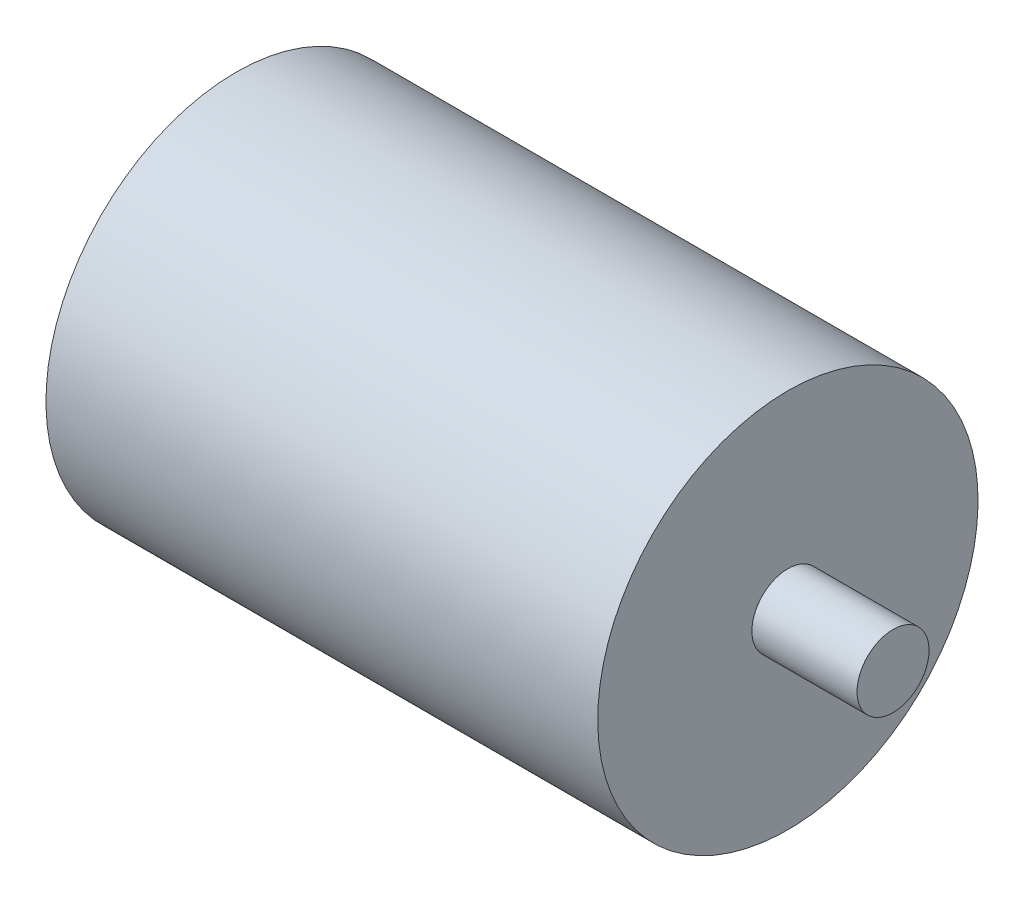
ISO-10303-21;
HEADER;
FILE_DESCRIPTION(('STEP AP214'),'2;1');
FILE_NAME('part.step','',(''),(''),'','','');
FILE_SCHEMA(('AUTOMOTIVE_DESIGN { 1 0 10303 214 1 1 1 1 }'));
ENDSEC;
DATA;
#1=APPLICATION_CONTEXT('core data for automotive mechanical design processes');
#2=APPLICATION_PROTOCOL_DEFINITION('international standard','automotive_design',2000,#1);
#3=PRODUCT_CONTEXT('',#1,'mechanical');
#4=PRODUCT('Part','Part','',(#3));
#5=PRODUCT_RELATED_PRODUCT_CATEGORY('part','',(#4));
#6=PRODUCT_DEFINITION_FORMATION('','',#4);
#7=PRODUCT_DEFINITION_CONTEXT('part definition',#1,'design');
#8=PRODUCT_DEFINITION('design','',#6,#7);
#9=PRODUCT_DEFINITION_SHAPE('','',#8);
#10=(LENGTH_UNIT() NAMED_UNIT(*) SI_UNIT(.MILLI.,.METRE.));
#11=(NAMED_UNIT(*) PLANE_ANGLE_UNIT() SI_UNIT($,.RADIAN.));
#12=(NAMED_UNIT(*) SI_UNIT($,.STERADIAN.) SOLID_ANGLE_UNIT());
#13=UNCERTAINTY_MEASURE_WITH_UNIT(LENGTH_MEASURE(1.E-05),#10,'distance_accuracy_value','');
#14=(GEOMETRIC_REPRESENTATION_CONTEXT(3) GLOBAL_UNCERTAINTY_ASSIGNED_CONTEXT((#13)) GLOBAL_UNIT_ASSIGNED_CONTEXT((#10,
#11,#12)) REPRESENTATION_CONTEXT('',''));
#15=CARTESIAN_POINT('',(0.,0.,0.));
#16=DIRECTION('',(0.,0.,1.));
#17=DIRECTION('',(1.,0.,0.));
#18=AXIS2_PLACEMENT_3D('',#15,#16,#17);
#19=CARTESIAN_POINT('',(-48.641,0.,0.));
#20=DIRECTION('',(1.,0.,0.));
#21=DIRECTION('',(0.,1.,0.));
#22=AXIS2_PLACEMENT_3D('',#19,#20,#21);
#23=PLANE('',#22);
#24=CARTESIAN_POINT('',(-48.641,0.,0.));
#25=DIRECTION('',(-1.,0.,0.));
#26=DIRECTION('',(0.,-1.,0.));
#27=AXIS2_PLACEMENT_3D('',#24,#25,#26);
#28=CIRCLE('',#27,6.35);
#29=CARTESIAN_POINT('',(-48.641,-6.35,0.));
#30=VERTEX_POINT('',#29);
#31=EDGE_CURVE('E11',#30,#30,#28,.T.);
#32=ORIENTED_EDGE('',*,*,#31,.F.);
#33=EDGE_LOOP('',(#32));
#34=FACE_BOUND('',#33,.T.);
#35=CARTESIAN_POINT('',(-48.641,0.,0.));
#36=DIRECTION('',(1.,0.,0.));
#37=DIRECTION('',(0.,1.,0.));
#38=AXIS2_PLACEMENT_3D('',#35,#36,#37);
#39=CIRCLE('',#38,33.528);
#40=CARTESIAN_POINT('',(-48.641,33.528,0.));
#41=VERTEX_POINT('',#40);
#42=EDGE_CURVE('E68',#41,#41,#39,.T.);
#43=ORIENTED_EDGE('',*,*,#42,.F.);
#44=EDGE_LOOP('',(#43));
#45=FACE_BOUND('',#44,.T.);
#46=ADVANCED_FACE('F49',(#34,#45),#23,.F.);
#47=CARTESIAN_POINT('',(48.641,0.,0.));
#48=DIRECTION('',(1.,0.,0.));
#49=DIRECTION('',(0.,1.,0.));
#50=AXIS2_PLACEMENT_3D('',#47,#48,#49);
#51=PLANE('',#50);
#52=CARTESIAN_POINT('',(48.641,0.,0.));
#53=DIRECTION('',(1.,0.,0.));
#54=DIRECTION('',(0.,1.,0.));
#55=AXIS2_PLACEMENT_3D('',#52,#53,#54);
#56=CIRCLE('',#55,6.35);
#57=CARTESIAN_POINT('',(48.641,6.35000000000002,0.));
#58=VERTEX_POINT('',#57);
#59=EDGE_CURVE('E56',#58,#58,#56,.T.);
#60=ORIENTED_EDGE('',*,*,#59,.F.);
#61=EDGE_LOOP('',(#60));
#62=FACE_BOUND('',#61,.T.);
#63=CARTESIAN_POINT('',(48.641,0.,0.));
#64=DIRECTION('',(1.,0.,0.));
#65=DIRECTION('',(0.,1.,0.));
#66=AXIS2_PLACEMENT_3D('',#63,#64,#65);
#67=CIRCLE('',#66,33.528);
#68=CARTESIAN_POINT('',(48.641,33.528,0.));
#69=VERTEX_POINT('',#68);
#70=EDGE_CURVE('E52',#69,#69,#67,.T.);
#71=ORIENTED_EDGE('',*,*,#70,.T.);
#72=EDGE_LOOP('',(#71));
#73=FACE_BOUND('',#72,.T.);
#74=ADVANCED_FACE('F75',(#62,#73),#51,.T.);
#75=CARTESIAN_POINT('',(-48.641,0.,0.));
#76=DIRECTION('',(1.,0.,0.));
#77=DIRECTION('',(0.,1.,0.));
#78=AXIS2_PLACEMENT_3D('',#75,#76,#77);
#79=CYLINDRICAL_SURFACE('',#78,33.528);
#80=ORIENTED_EDGE('',*,*,#70,.F.);
#81=EDGE_LOOP('',(#80));
#82=FACE_BOUND('',#81,.T.);
#83=ORIENTED_EDGE('',*,*,#42,.T.);
#84=EDGE_LOOP('',(#83));
#85=FACE_BOUND('',#84,.T.);
#86=ADVANCED_FACE('F77',(#82,#85),#79,.T.);
#87=CARTESIAN_POINT('',(67.183,0.,0.));
#88=DIRECTION('',(1.,0.,0.));
#89=DIRECTION('',(0.,1.,0.));
#90=AXIS2_PLACEMENT_3D('',#87,#88,#89);
#91=PLANE('',#90);
#92=CARTESIAN_POINT('',(67.183,0.,0.));
#93=DIRECTION('',(1.,0.,0.));
#94=DIRECTION('',(0.,1.,0.));
#95=AXIS2_PLACEMENT_3D('',#92,#93,#94);
#96=CIRCLE('',#95,6.35);
#97=CARTESIAN_POINT('',(67.183,6.35,0.));
#98=VERTEX_POINT('',#97);
#99=EDGE_CURVE('E65',#98,#98,#96,.T.);
#100=ORIENTED_EDGE('',*,*,#99,.T.);
#101=EDGE_LOOP('',(#100));
#102=FACE_BOUND('',#101,.T.);
#103=ADVANCED_FACE('F79',(#102),#91,.T.);
#104=CARTESIAN_POINT('',(48.641,0.,0.));
#105=DIRECTION('',(1.,0.,0.));
#106=DIRECTION('',(0.,1.,0.));
#107=AXIS2_PLACEMENT_3D('',#104,#105,#106);
#108=CYLINDRICAL_SURFACE('',#107,6.35);
#109=ORIENTED_EDGE('',*,*,#99,.F.);
#110=EDGE_LOOP('',(#109));
#111=FACE_BOUND('',#110,.T.);
#112=ORIENTED_EDGE('',*,*,#59,.T.);
#113=EDGE_LOOP('',(#112));
#114=FACE_BOUND('',#113,.T.);
#115=ADVANCED_FACE('F85',(#111,#114),#108,.T.);
#116=CARTESIAN_POINT('',(-67.183,0.,0.));
#117=DIRECTION('',(-1.,0.,0.));
#118=DIRECTION('',(0.,-1.,0.));
#119=AXIS2_PLACEMENT_3D('',#116,#117,#118);
#120=PLANE('',#119);
#121=CARTESIAN_POINT('',(-67.183,0.,0.));
#122=DIRECTION('',(-1.,0.,0.));
#123=DIRECTION('',(0.,-1.,0.));
#124=AXIS2_PLACEMENT_3D('',#121,#122,#123);
#125=CIRCLE('',#124,6.35);
#126=CARTESIAN_POINT('',(-67.183,-6.35,0.));
#127=VERTEX_POINT('',#126);
#128=EDGE_CURVE('E63',#127,#127,#125,.T.);
#129=ORIENTED_EDGE('',*,*,#128,.T.);
#130=EDGE_LOOP('',(#129));
#131=FACE_BOUND('',#130,.T.);
#132=ADVANCED_FACE('F93',(#131),#120,.T.);
#133=CARTESIAN_POINT('',(-48.641,0.,0.));
#134=DIRECTION('',(-1.,0.,0.));
#135=DIRECTION('',(0.,-1.,0.));
#136=AXIS2_PLACEMENT_3D('',#133,#134,#135);
#137=CYLINDRICAL_SURFACE('',#136,6.35);
#138=ORIENTED_EDGE('',*,*,#128,.F.);
#139=EDGE_LOOP('',(#138));
#140=FACE_BOUND('',#139,.T.);
#141=ORIENTED_EDGE('',*,*,#31,.T.);
#142=EDGE_LOOP('',(#141));
#143=FACE_BOUND('',#142,.T.);
#144=ADVANCED_FACE('F88',(#140,#143),#137,.T.);
#145=CLOSED_SHELL('',(#46,#74,#86,#103,#115,#132,#144));
#146=MANIFOLD_SOLID_BREP('B2',#145);
#147=ADVANCED_BREP_SHAPE_REPRESENTATION('',(#18,#146),#14);
#148=SHAPE_DEFINITION_REPRESENTATION(#9,#147);
ENDSEC;
END-ISO-10303-21;
